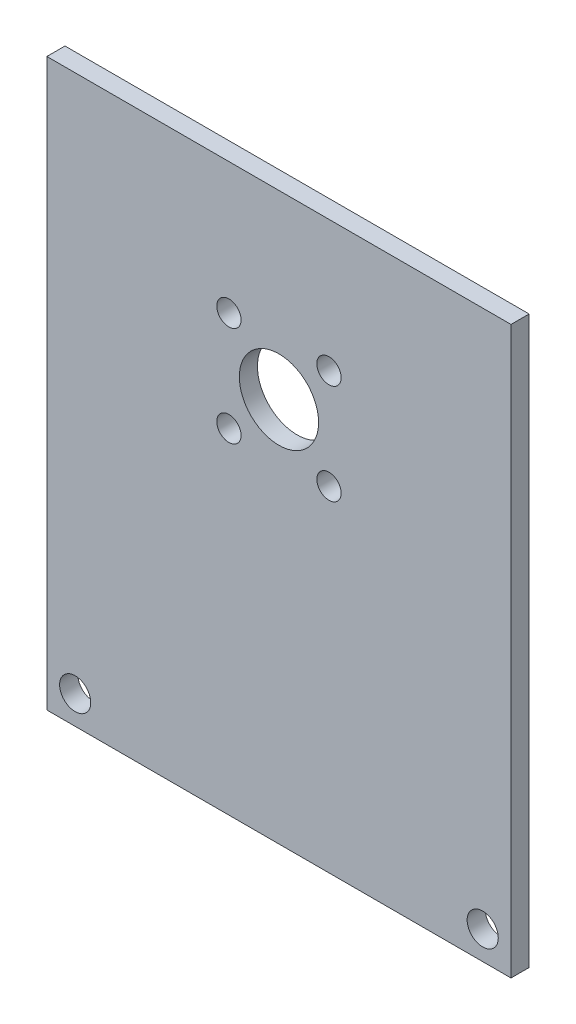
ISO-10303-21;
HEADER;
FILE_DESCRIPTION(('STEP AP214'),'2;1');
FILE_NAME('part.step','',(''),(''),'','','');
FILE_SCHEMA(('AUTOMOTIVE_DESIGN { 1 0 10303 214 1 1 1 1 }'));
ENDSEC;
DATA;
#1=APPLICATION_CONTEXT('core data for automotive mechanical design processes');
#2=APPLICATION_PROTOCOL_DEFINITION('international standard','automotive_design',2000,#1);
#3=PRODUCT_CONTEXT('',#1,'mechanical');
#4=PRODUCT('Part','Part','',(#3));
#5=PRODUCT_RELATED_PRODUCT_CATEGORY('part','',(#4));
#6=PRODUCT_DEFINITION_FORMATION('','',#4);
#7=PRODUCT_DEFINITION_CONTEXT('part definition',#1,'design');
#8=PRODUCT_DEFINITION('design','',#6,#7);
#9=PRODUCT_DEFINITION_SHAPE('','',#8);
#10=(LENGTH_UNIT() NAMED_UNIT(*) SI_UNIT(.MILLI.,.METRE.));
#11=(NAMED_UNIT(*) PLANE_ANGLE_UNIT() SI_UNIT($,.RADIAN.));
#12=(NAMED_UNIT(*) SI_UNIT($,.STERADIAN.) SOLID_ANGLE_UNIT());
#13=UNCERTAINTY_MEASURE_WITH_UNIT(LENGTH_MEASURE(1.E-05),#10,'distance_accuracy_value','');
#14=(GEOMETRIC_REPRESENTATION_CONTEXT(3) GLOBAL_UNCERTAINTY_ASSIGNED_CONTEXT((#13)) GLOBAL_UNIT_ASSIGNED_CONTEXT((#10,
#11,#12)) REPRESENTATION_CONTEXT('',''));
#15=CARTESIAN_POINT('',(0.,0.,0.));
#16=DIRECTION('',(0.,0.,1.));
#17=DIRECTION('',(1.,0.,0.));
#18=AXIS2_PLACEMENT_3D('',#15,#16,#17);
#19=CARTESIAN_POINT('',(-75.,-80.,3.2));
#20=DIRECTION('',(0.,1.,0.));
#21=DIRECTION('',(0.,0.,1.));
#22=AXIS2_PLACEMENT_3D('',#19,#20,#21);
#23=PLANE('',#22);
#24=DIRECTION('',(0.,0.,1.));
#25=VECTOR('',#24,1.);
#26=CARTESIAN_POINT('',(-41.,-80.,-6.8));
#27=LINE('',#26,#25);
#28=CARTESIAN_POINT('',(-41.,-80.,0.));
#29=VERTEX_POINT('',#28);
#30=CARTESIAN_POINT('',(-41.,-80.,3.2));
#31=VERTEX_POINT('',#30);
#32=EDGE_CURVE('E88',#29,#31,#27,.T.);
#33=ORIENTED_EDGE('',*,*,#32,.F.);
#34=DIRECTION('',(1.,0.,0.));
#35=VECTOR('',#34,1.);
#36=CARTESIAN_POINT('',(-75.,-80.,0.));
#37=LINE('',#36,#35);
#38=CARTESIAN_POINT('',(41.,-80.,0.));
#39=VERTEX_POINT('',#38);
#40=EDGE_CURVE('E87',#29,#39,#37,.T.);
#41=ORIENTED_EDGE('',*,*,#40,.T.);
#42=DIRECTION('',(0.,0.,1.));
#43=VECTOR('',#42,1.);
#44=CARTESIAN_POINT('',(41.,-80.,-6.8));
#45=LINE('',#44,#43);
#46=CARTESIAN_POINT('',(41.,-80.,3.2));
#47=VERTEX_POINT('',#46);
#48=EDGE_CURVE('E48',#39,#47,#45,.T.);
#49=ORIENTED_EDGE('',*,*,#48,.T.);
#50=DIRECTION('',(1.,0.,0.));
#51=VECTOR('',#50,1.);
#52=CARTESIAN_POINT('',(-75.,-80.,3.2));
#53=LINE('',#52,#51);
#54=EDGE_CURVE('E85',#31,#47,#53,.T.);
#55=ORIENTED_EDGE('',*,*,#54,.F.);
#56=EDGE_LOOP('',(#33,#41,#49,#55));
#57=FACE_BOUND('',#56,.T.);
#58=ADVANCED_FACE('F34',(#57),#23,.F.);
#59=CARTESIAN_POINT('',(0.,0.,3.2));
#60=DIRECTION('',(0.,0.,1.));
#61=DIRECTION('',(1.,0.,0.));
#62=AXIS2_PLACEMENT_3D('',#59,#60,#61);
#63=PLANE('',#62);
#64=CARTESIAN_POINT('',(8.8388347648317,-3.16116523516802,3.2));
#65=DIRECTION('',(0.,0.,1.));
#66=DIRECTION('',(0.,-1.,0.));
#67=AXIS2_PLACEMENT_3D('',#64,#65,#66);
#68=CIRCLE('',#67,2.15);
#69=CARTESIAN_POINT('',(8.83883476483172,-5.31116523516803,3.2));
#70=VERTEX_POINT('',#69);
#71=EDGE_CURVE('E135',#70,#70,#68,.T.);
#72=ORIENTED_EDGE('',*,*,#71,.F.);
#73=EDGE_LOOP('',(#72));
#74=FACE_BOUND('',#73,.T.);
#75=CARTESIAN_POINT('',(8.83883476483189,-20.8388347648318,3.2));
#76=DIRECTION('',(0.,0.,1.));
#77=DIRECTION('',(-1.,0.,0.));
#78=AXIS2_PLACEMENT_3D('',#75,#76,#77);
#79=CIRCLE('',#78,2.15);
#80=CARTESIAN_POINT('',(6.68883476483189,-20.8388347648318,3.2));
#81=VERTEX_POINT('',#80);
#82=EDGE_CURVE('E129',#81,#81,#79,.T.);
#83=ORIENTED_EDGE('',*,*,#82,.F.);
#84=EDGE_LOOP('',(#83));
#85=FACE_BOUND('',#84,.T.);
#86=CARTESIAN_POINT('',(-8.83883476483176,-20.8388347648319,3.2));
#87=DIRECTION('',(0.,0.,1.));
#88=DIRECTION('',(0.,1.,0.));
#89=AXIS2_PLACEMENT_3D('',#86,#87,#88);
#90=CIRCLE('',#89,2.15);
#91=CARTESIAN_POINT('',(-8.83883476483177,-18.6888347648319,3.2));
#92=VERTEX_POINT('',#91);
#93=EDGE_CURVE('E123',#92,#92,#90,.T.);
#94=ORIENTED_EDGE('',*,*,#93,.F.);
#95=EDGE_LOOP('',(#94));
#96=FACE_BOUND('',#95,.T.);
#97=CARTESIAN_POINT('',(-8.83883476483189,-3.16116523516822,3.2));
#98=DIRECTION('',(0.,0.,1.));
#99=DIRECTION('',(1.,0.,0.));
#100=AXIS2_PLACEMENT_3D('',#97,#98,#99);
#101=CIRCLE('',#100,2.15);
#102=CARTESIAN_POINT('',(-6.68883476483189,-3.16116523516822,3.2));
#103=VERTEX_POINT('',#102);
#104=EDGE_CURVE('E117',#103,#103,#101,.T.);
#105=ORIENTED_EDGE('',*,*,#104,.F.);
#106=EDGE_LOOP('',(#105));
#107=FACE_BOUND('',#106,.T.);
#108=CARTESIAN_POINT('',(36.,-74.9999999999998,3.2));
#109=DIRECTION('',(0.,0.,1.));
#110=DIRECTION('',(1.,0.,0.));
#111=AXIS2_PLACEMENT_3D('',#108,#109,#110);
#112=CIRCLE('',#111,2.74999999999993);
#113=CARTESIAN_POINT('',(38.7499999999999,-74.9999999999998,3.2));
#114=VERTEX_POINT('',#113);
#115=EDGE_CURVE('E113',#114,#114,#112,.T.);
#116=ORIENTED_EDGE('',*,*,#115,.F.);
#117=EDGE_LOOP('',(#116));
#118=FACE_BOUND('',#117,.T.);
#119=CARTESIAN_POINT('',(-36.,-74.9999999999998,3.2));
#120=DIRECTION('',(0.,0.,1.));
#121=DIRECTION('',(1.,0.,0.));
#122=AXIS2_PLACEMENT_3D('',#119,#120,#121);
#123=CIRCLE('',#122,2.74999999999994);
#124=CARTESIAN_POINT('',(-33.2500000000001,-74.9999999999998,3.2));
#125=VERTEX_POINT('',#124);
#126=EDGE_CURVE('E107',#125,#125,#123,.T.);
#127=ORIENTED_EDGE('',*,*,#126,.F.);
#128=EDGE_LOOP('',(#127));
#129=FACE_BOUND('',#128,.T.);
#130=CARTESIAN_POINT('',(0.,-12.,3.2));
#131=DIRECTION('',(0.,0.,1.));
#132=DIRECTION('',(1.,0.,0.));
#133=AXIS2_PLACEMENT_3D('',#130,#131,#132);
#134=CIRCLE('',#133,7.);
#135=CARTESIAN_POINT('',(7.,-12.,3.2));
#136=VERTEX_POINT('',#135);
#137=EDGE_CURVE('E101',#136,#136,#134,.T.);
#138=ORIENTED_EDGE('',*,*,#137,.F.);
#139=EDGE_LOOP('',(#138));
#140=FACE_BOUND('',#139,.T.);
#141=DIRECTION('',(-1.,0.,0.));
#142=VECTOR('',#141,1.);
#143=CARTESIAN_POINT('',(-41.,20.,3.2));
#144=LINE('',#143,#142);
#145=CARTESIAN_POINT('',(41.,20.,3.2));
#146=VERTEX_POINT('',#145);
#147=CARTESIAN_POINT('',(-41.,20.,3.2));
#148=VERTEX_POINT('',#147);
#149=EDGE_CURVE('E78',#146,#148,#144,.T.);
#150=ORIENTED_EDGE('',*,*,#149,.T.);
#151=DIRECTION('',(0.,-1.,0.));
#152=VECTOR('',#151,1.);
#153=CARTESIAN_POINT('',(-41.,20.,3.2));
#154=LINE('',#153,#152);
#155=EDGE_CURVE('E79',#148,#31,#154,.T.);
#156=ORIENTED_EDGE('',*,*,#155,.T.);
#157=ORIENTED_EDGE('',*,*,#54,.T.);
#158=DIRECTION('',(0.,1.,0.));
#159=VECTOR('',#158,1.);
#160=CARTESIAN_POINT('',(41.,-80.,3.2));
#161=LINE('',#160,#159);
#162=EDGE_CURVE('E71',#47,#146,#161,.T.);
#163=ORIENTED_EDGE('',*,*,#162,.T.);
#164=EDGE_LOOP('',(#150,#156,#157,#163));
#165=FACE_BOUND('',#164,.T.);
#166=ADVANCED_FACE('F91',(#74,#85,#96,#107,#118,#129,#140,#165),#63,.T.);
#167=CARTESIAN_POINT('',(0.,0.,0.));
#168=DIRECTION('',(0.,0.,1.));
#169=DIRECTION('',(1.,0.,0.));
#170=AXIS2_PLACEMENT_3D('',#167,#168,#169);
#171=PLANE('',#170);
#172=CARTESIAN_POINT('',(0.,-12.,0.));
#173=DIRECTION('',(0.,0.,1.));
#174=DIRECTION('',(1.,0.,0.));
#175=AXIS2_PLACEMENT_3D('',#172,#173,#174);
#176=CIRCLE('',#175,7.);
#177=CARTESIAN_POINT('',(7.,-12.,0.));
#178=VERTEX_POINT('',#177);
#179=EDGE_CURVE('E96',#178,#178,#176,.F.);
#180=ORIENTED_EDGE('',*,*,#179,.F.);
#181=EDGE_LOOP('',(#180));
#182=FACE_BOUND('',#181,.T.);
#183=CARTESIAN_POINT('',(-36.,-74.9999999999998,0.));
#184=DIRECTION('',(0.,0.,1.));
#185=DIRECTION('',(1.,0.,0.));
#186=AXIS2_PLACEMENT_3D('',#183,#184,#185);
#187=CIRCLE('',#186,2.74999999999994);
#188=CARTESIAN_POINT('',(-33.2500000000001,-74.9999999999998,0.));
#189=VERTEX_POINT('',#188);
#190=EDGE_CURVE('E104',#189,#189,#187,.F.);
#191=ORIENTED_EDGE('',*,*,#190,.F.);
#192=EDGE_LOOP('',(#191));
#193=FACE_BOUND('',#192,.T.);
#194=CARTESIAN_POINT('',(36.,-74.9999999999998,0.));
#195=DIRECTION('',(0.,0.,1.));
#196=DIRECTION('',(1.,0.,0.));
#197=AXIS2_PLACEMENT_3D('',#194,#195,#196);
#198=CIRCLE('',#197,2.74999999999993);
#199=CARTESIAN_POINT('',(38.7499999999999,-74.9999999999998,0.));
#200=VERTEX_POINT('',#199);
#201=EDGE_CURVE('E110',#200,#200,#198,.F.);
#202=ORIENTED_EDGE('',*,*,#201,.F.);
#203=EDGE_LOOP('',(#202));
#204=FACE_BOUND('',#203,.T.);
#205=CARTESIAN_POINT('',(-8.83883476483189,-3.16116523516822,0.));
#206=DIRECTION('',(0.,0.,1.));
#207=DIRECTION('',(1.,0.,0.));
#208=AXIS2_PLACEMENT_3D('',#205,#206,#207);
#209=CIRCLE('',#208,2.15);
#210=CARTESIAN_POINT('',(-6.68883476483189,-3.16116523516822,0.));
#211=VERTEX_POINT('',#210);
#212=EDGE_CURVE('E116',#211,#211,#209,.T.);
#213=ORIENTED_EDGE('',*,*,#212,.T.);
#214=EDGE_LOOP('',(#213));
#215=FACE_BOUND('',#214,.T.);
#216=CARTESIAN_POINT('',(-8.83883476483176,-20.8388347648319,0.));
#217=DIRECTION('',(0.,0.,1.));
#218=DIRECTION('',(0.,1.,0.));
#219=AXIS2_PLACEMENT_3D('',#216,#217,#218);
#220=CIRCLE('',#219,2.15);
#221=CARTESIAN_POINT('',(-8.83883476483177,-18.6888347648319,0.));
#222=VERTEX_POINT('',#221);
#223=EDGE_CURVE('E120',#222,#222,#220,.T.);
#224=ORIENTED_EDGE('',*,*,#223,.T.);
#225=EDGE_LOOP('',(#224));
#226=FACE_BOUND('',#225,.T.);
#227=CARTESIAN_POINT('',(8.83883476483189,-20.8388347648318,0.));
#228=DIRECTION('',(0.,0.,1.));
#229=DIRECTION('',(-1.,0.,0.));
#230=AXIS2_PLACEMENT_3D('',#227,#228,#229);
#231=CIRCLE('',#230,2.15);
#232=CARTESIAN_POINT('',(6.68883476483189,-20.8388347648318,0.));
#233=VERTEX_POINT('',#232);
#234=EDGE_CURVE('E126',#233,#233,#231,.T.);
#235=ORIENTED_EDGE('',*,*,#234,.T.);
#236=EDGE_LOOP('',(#235));
#237=FACE_BOUND('',#236,.T.);
#238=CARTESIAN_POINT('',(8.8388347648317,-3.16116523516802,0.));
#239=DIRECTION('',(0.,0.,1.));
#240=DIRECTION('',(0.,-1.,0.));
#241=AXIS2_PLACEMENT_3D('',#238,#239,#240);
#242=CIRCLE('',#241,2.15);
#243=CARTESIAN_POINT('',(8.83883476483172,-5.31116523516803,0.));
#244=VERTEX_POINT('',#243);
#245=EDGE_CURVE('E132',#244,#244,#242,.T.);
#246=ORIENTED_EDGE('',*,*,#245,.T.);
#247=EDGE_LOOP('',(#246));
#248=FACE_BOUND('',#247,.T.);
#249=DIRECTION('',(0.,-1.,0.));
#250=VECTOR('',#249,1.);
#251=CARTESIAN_POINT('',(-41.,0.,0.));
#252=LINE('',#251,#250);
#253=CARTESIAN_POINT('',(-41.,20.,0.));
#254=VERTEX_POINT('',#253);
#255=EDGE_CURVE('E12',#254,#29,#252,.T.);
#256=ORIENTED_EDGE('',*,*,#255,.F.);
#257=DIRECTION('',(-1.,0.,0.));
#258=VECTOR('',#257,1.);
#259=CARTESIAN_POINT('',(0.,20.,0.));
#260=LINE('',#259,#258);
#261=CARTESIAN_POINT('',(41.,20.,0.));
#262=VERTEX_POINT('',#261);
#263=EDGE_CURVE('E41',#262,#254,#260,.T.);
#264=ORIENTED_EDGE('',*,*,#263,.F.);
#265=DIRECTION('',(0.,1.,0.));
#266=VECTOR('',#265,1.);
#267=CARTESIAN_POINT('',(41.,0.,0.));
#268=LINE('',#267,#266);
#269=EDGE_CURVE('E93',#39,#262,#268,.T.);
#270=ORIENTED_EDGE('',*,*,#269,.F.);
#271=ORIENTED_EDGE('',*,*,#40,.F.);
#272=EDGE_LOOP('',(#256,#264,#270,#271));
#273=FACE_BOUND('',#272,.T.);
#274=ADVANCED_FACE('F150',(#182,#193,#204,#215,#226,#237,#248,#273),#171,.F.);
#275=CARTESIAN_POINT('',(0.,-12.,-0.00100000000000013));
#276=DIRECTION('',(0.,0.,1.));
#277=DIRECTION('',(1.,0.,0.));
#278=AXIS2_PLACEMENT_3D('',#275,#276,#277);
#279=CYLINDRICAL_SURFACE('',#278,7.);
#280=ORIENTED_EDGE('',*,*,#137,.T.);
#281=EDGE_LOOP('',(#280));
#282=FACE_BOUND('',#281,.T.);
#283=ORIENTED_EDGE('',*,*,#179,.T.);
#284=EDGE_LOOP('',(#283));
#285=FACE_BOUND('',#284,.T.);
#286=ADVANCED_FACE('F152',(#282,#285),#279,.F.);
#287=CARTESIAN_POINT('',(-36.,-74.9999999999998,-0.00100000000000013));
#288=DIRECTION('',(0.,0.,1.));
#289=DIRECTION('',(1.,0.,0.));
#290=AXIS2_PLACEMENT_3D('',#287,#288,#289);
#291=CYLINDRICAL_SURFACE('',#290,2.74999999999994);
#292=ORIENTED_EDGE('',*,*,#126,.T.);
#293=EDGE_LOOP('',(#292));
#294=FACE_BOUND('',#293,.T.);
#295=ORIENTED_EDGE('',*,*,#190,.T.);
#296=EDGE_LOOP('',(#295));
#297=FACE_BOUND('',#296,.T.);
#298=ADVANCED_FACE('F158',(#294,#297),#291,.F.);
#299=CARTESIAN_POINT('',(36.,-74.9999999999998,-0.00100000000000013));
#300=DIRECTION('',(0.,0.,1.));
#301=DIRECTION('',(1.,0.,0.));
#302=AXIS2_PLACEMENT_3D('',#299,#300,#301);
#303=CYLINDRICAL_SURFACE('',#302,2.74999999999993);
#304=ORIENTED_EDGE('',*,*,#115,.T.);
#305=EDGE_LOOP('',(#304));
#306=FACE_BOUND('',#305,.T.);
#307=ORIENTED_EDGE('',*,*,#201,.T.);
#308=EDGE_LOOP('',(#307));
#309=FACE_BOUND('',#308,.T.);
#310=ADVANCED_FACE('F222',(#306,#309),#303,.F.);
#311=CARTESIAN_POINT('',(-8.83883476483189,-3.16116523516822,0.));
#312=DIRECTION('',(0.,0.,1.));
#313=DIRECTION('',(1.,0.,0.));
#314=AXIS2_PLACEMENT_3D('',#311,#312,#313);
#315=CYLINDRICAL_SURFACE('',#314,2.15);
#316=ORIENTED_EDGE('',*,*,#212,.F.);
#317=EDGE_LOOP('',(#316));
#318=FACE_BOUND('',#317,.T.);
#319=ORIENTED_EDGE('',*,*,#104,.T.);
#320=EDGE_LOOP('',(#319));
#321=FACE_BOUND('',#320,.T.);
#322=ADVANCED_FACE('F218',(#318,#321),#315,.F.);
#323=CARTESIAN_POINT('',(-8.83883476483176,-20.8388347648319,0.));
#324=DIRECTION('',(0.,0.,1.));
#325=DIRECTION('',(1.,0.,0.));
#326=AXIS2_PLACEMENT_3D('',#323,#324,#325);
#327=CYLINDRICAL_SURFACE('',#326,2.15);
#328=ORIENTED_EDGE('',*,*,#223,.F.);
#329=EDGE_LOOP('',(#328));
#330=FACE_BOUND('',#329,.T.);
#331=ORIENTED_EDGE('',*,*,#93,.T.);
#332=EDGE_LOOP('',(#331));
#333=FACE_BOUND('',#332,.T.);
#334=ADVANCED_FACE('F214',(#330,#333),#327,.F.);
#335=CARTESIAN_POINT('',(8.83883476483189,-20.8388347648318,0.));
#336=DIRECTION('',(0.,0.,1.));
#337=DIRECTION('',(1.,0.,0.));
#338=AXIS2_PLACEMENT_3D('',#335,#336,#337);
#339=CYLINDRICAL_SURFACE('',#338,2.15);
#340=ORIENTED_EDGE('',*,*,#234,.F.);
#341=EDGE_LOOP('',(#340));
#342=FACE_BOUND('',#341,.T.);
#343=ORIENTED_EDGE('',*,*,#82,.T.);
#344=EDGE_LOOP('',(#343));
#345=FACE_BOUND('',#344,.T.);
#346=ADVANCED_FACE('F210',(#342,#345),#339,.F.);
#347=CARTESIAN_POINT('',(8.8388347648317,-3.16116523516802,0.));
#348=DIRECTION('',(0.,0.,1.));
#349=DIRECTION('',(1.,0.,0.));
#350=AXIS2_PLACEMENT_3D('',#347,#348,#349);
#351=CYLINDRICAL_SURFACE('',#350,2.15);
#352=ORIENTED_EDGE('',*,*,#245,.F.);
#353=EDGE_LOOP('',(#352));
#354=FACE_BOUND('',#353,.T.);
#355=ORIENTED_EDGE('',*,*,#71,.T.);
#356=EDGE_LOOP('',(#355));
#357=FACE_BOUND('',#356,.T.);
#358=ADVANCED_FACE('F187',(#354,#357),#351,.F.);
#359=CARTESIAN_POINT('',(-41.,20.,-6.8));
#360=DIRECTION('',(-1.,0.,0.));
#361=DIRECTION('',(0.,-1.,0.));
#362=AXIS2_PLACEMENT_3D('',#359,#360,#361);
#363=PLANE('',#362);
#364=ORIENTED_EDGE('',*,*,#255,.T.);
#365=ORIENTED_EDGE('',*,*,#32,.T.);
#366=ORIENTED_EDGE('',*,*,#155,.F.);
#367=DIRECTION('',(0.,0.,1.));
#368=VECTOR('',#367,1.);
#369=CARTESIAN_POINT('',(-41.,20.,-6.8));
#370=LINE('',#369,#368);
#371=EDGE_CURVE('E138',#254,#148,#370,.T.);
#372=ORIENTED_EDGE('',*,*,#371,.F.);
#373=EDGE_LOOP('',(#364,#365,#366,#372));
#374=FACE_BOUND('',#373,.T.);
#375=ADVANCED_FACE('F148',(#374),#363,.T.);
#376=CARTESIAN_POINT('',(-41.,20.,-6.8));
#377=DIRECTION('',(0.,1.,0.));
#378=DIRECTION('',(-1.,0.,0.));
#379=AXIS2_PLACEMENT_3D('',#376,#377,#378);
#380=PLANE('',#379);
#381=ORIENTED_EDGE('',*,*,#263,.T.);
#382=ORIENTED_EDGE('',*,*,#371,.T.);
#383=ORIENTED_EDGE('',*,*,#149,.F.);
#384=DIRECTION('',(0.,0.,1.));
#385=VECTOR('',#384,1.);
#386=CARTESIAN_POINT('',(41.,20.,-6.8));
#387=LINE('',#386,#385);
#388=EDGE_CURVE('E73',#262,#146,#387,.T.);
#389=ORIENTED_EDGE('',*,*,#388,.F.);
#390=EDGE_LOOP('',(#381,#382,#383,#389));
#391=FACE_BOUND('',#390,.T.);
#392=ADVANCED_FACE('F145',(#391),#380,.T.);
#393=CARTESIAN_POINT('',(41.,-80.,-6.8));
#394=DIRECTION('',(1.,0.,0.));
#395=DIRECTION('',(0.,0.,-1.));
#396=AXIS2_PLACEMENT_3D('',#393,#394,#395);
#397=PLANE('',#396);
#398=ORIENTED_EDGE('',*,*,#269,.T.);
#399=ORIENTED_EDGE('',*,*,#388,.T.);
#400=ORIENTED_EDGE('',*,*,#162,.F.);
#401=ORIENTED_EDGE('',*,*,#48,.F.);
#402=EDGE_LOOP('',(#398,#399,#400,#401));
#403=FACE_BOUND('',#402,.T.);
#404=ADVANCED_FACE('F72',(#403),#397,.T.);
#405=CLOSED_SHELL('',(#58,#166,#274,#286,#298,#310,#322,#334,#346,#358,#375,#392,#404));
#406=MANIFOLD_SOLID_BREP('B2',#405);
#407=ADVANCED_BREP_SHAPE_REPRESENTATION('',(#18,#406),#14);
#408=SHAPE_DEFINITION_REPRESENTATION(#9,#407);
ENDSEC;
END-ISO-10303-21;
